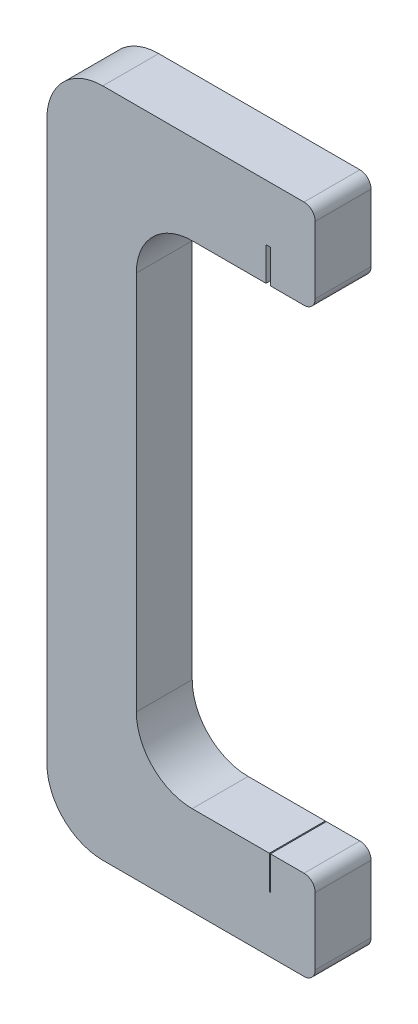
ISO-10303-21;
HEADER;
FILE_DESCRIPTION(('STEP AP214'),'2;1');
FILE_NAME('part.step','',(''),(''),'','','');
FILE_SCHEMA(('AUTOMOTIVE_DESIGN { 1 0 10303 214 1 1 1 1 }'));
ENDSEC;
DATA;
#1=APPLICATION_CONTEXT('core data for automotive mechanical design processes');
#2=APPLICATION_PROTOCOL_DEFINITION('international standard','automotive_design',2000,#1);
#3=PRODUCT_CONTEXT('',#1,'mechanical');
#4=PRODUCT('Part','Part','',(#3));
#5=PRODUCT_RELATED_PRODUCT_CATEGORY('part','',(#4));
#6=PRODUCT_DEFINITION_FORMATION('','',#4);
#7=PRODUCT_DEFINITION_CONTEXT('part definition',#1,'design');
#8=PRODUCT_DEFINITION('design','',#6,#7);
#9=PRODUCT_DEFINITION_SHAPE('','',#8);
#10=(LENGTH_UNIT() NAMED_UNIT(*) SI_UNIT(.MILLI.,.METRE.));
#11=(NAMED_UNIT(*) PLANE_ANGLE_UNIT() SI_UNIT($,.RADIAN.));
#12=(NAMED_UNIT(*) SI_UNIT($,.STERADIAN.) SOLID_ANGLE_UNIT());
#13=UNCERTAINTY_MEASURE_WITH_UNIT(LENGTH_MEASURE(1.E-05),#10,'distance_accuracy_value','');
#14=(GEOMETRIC_REPRESENTATION_CONTEXT(3) GLOBAL_UNCERTAINTY_ASSIGNED_CONTEXT((#13)) GLOBAL_UNIT_ASSIGNED_CONTEXT((#10,
#11,#12)) REPRESENTATION_CONTEXT('',''));
#15=CARTESIAN_POINT('',(0.,0.,0.));
#16=DIRECTION('',(0.,0.,1.));
#17=DIRECTION('',(1.,0.,0.));
#18=AXIS2_PLACEMENT_3D('',#15,#16,#17);
#19=CARTESIAN_POINT('',(13.,52.,5.));
#20=DIRECTION('',(0.,1.,0.));
#21=DIRECTION('',(-1.,0.,0.));
#22=AXIS2_PLACEMENT_3D('',#19,#20,#21);
#23=PLANE('',#22);
#24=DIRECTION('',(1.,0.,0.));
#25=VECTOR('',#24,1.);
#26=CARTESIAN_POINT('',(13.,52.,5.));
#27=LINE('',#26,#25);
#28=CARTESIAN_POINT('',(20.,52.,5.));
#29=VERTEX_POINT('',#28);
#30=CARTESIAN_POINT('',(23.,52.,5.));
#31=VERTEX_POINT('',#30);
#32=EDGE_CURVE('E281',#29,#31,#27,.T.);
#33=ORIENTED_EDGE('',*,*,#32,.F.);
#34=DIRECTION('',(0.,0.,1.));
#35=VECTOR('',#34,1.);
#36=CARTESIAN_POINT('',(20.,52.,0.));
#37=LINE('',#36,#35);
#38=CARTESIAN_POINT('',(20.,52.,0.));
#39=VERTEX_POINT('',#38);
#40=EDGE_CURVE('E204',#39,#29,#37,.T.);
#41=ORIENTED_EDGE('',*,*,#40,.F.);
#42=DIRECTION('',(1.,0.,0.));
#43=VECTOR('',#42,1.);
#44=CARTESIAN_POINT('',(13.,52.,0.));
#45=LINE('',#44,#43);
#46=CARTESIAN_POINT('',(23.,52.,0.));
#47=VERTEX_POINT('',#46);
#48=EDGE_CURVE('E317',#39,#47,#45,.T.);
#49=ORIENTED_EDGE('',*,*,#48,.T.);
#50=DIRECTION('',(0.,0.,-1.));
#51=VECTOR('',#50,1.);
#52=CARTESIAN_POINT('',(23.,52.,5.));
#53=LINE('',#52,#51);
#54=EDGE_CURVE('E339',#31,#47,#53,.T.);
#55=ORIENTED_EDGE('',*,*,#54,.F.);
#56=EDGE_LOOP('',(#33,#41,#49,#55));
#57=FACE_BOUND('',#56,.T.);
#58=ADVANCED_FACE('F37',(#57),#23,.F.);
#59=CARTESIAN_POINT('',(23.,8.,5.));
#60=DIRECTION('',(0.,-1.,0.));
#61=DIRECTION('',(1.,0.,0.));
#62=AXIS2_PLACEMENT_3D('',#59,#60,#61);
#63=PLANE('',#62);
#64=DIRECTION('',(-1.,0.,0.));
#65=VECTOR('',#64,1.);
#66=CARTESIAN_POINT('',(23.,8.,0.));
#67=LINE('',#66,#65);
#68=CARTESIAN_POINT('',(23.,8.,0.));
#69=VERTEX_POINT('',#68);
#70=CARTESIAN_POINT('',(20.,8.,0.));
#71=VERTEX_POINT('',#70);
#72=EDGE_CURVE('E308',#69,#71,#67,.T.);
#73=ORIENTED_EDGE('',*,*,#72,.T.);
#74=DIRECTION('',(0.,0.,-1.));
#75=VECTOR('',#74,1.);
#76=CARTESIAN_POINT('',(20.,8.,5.));
#77=LINE('',#76,#75);
#78=CARTESIAN_POINT('',(20.,8.,5.));
#79=VERTEX_POINT('',#78);
#80=EDGE_CURVE('E228',#79,#71,#77,.T.);
#81=ORIENTED_EDGE('',*,*,#80,.F.);
#82=DIRECTION('',(-1.,0.,0.));
#83=VECTOR('',#82,1.);
#84=CARTESIAN_POINT('',(23.,8.,5.));
#85=LINE('',#84,#83);
#86=CARTESIAN_POINT('',(23.,8.,5.));
#87=VERTEX_POINT('',#86);
#88=EDGE_CURVE('E272',#87,#79,#85,.T.);
#89=ORIENTED_EDGE('',*,*,#88,.F.);
#90=DIRECTION('',(0.,0.,-1.));
#91=VECTOR('',#90,1.);
#92=CARTESIAN_POINT('',(23.,8.,5.));
#93=LINE('',#92,#91);
#94=EDGE_CURVE('E354',#87,#69,#93,.T.);
#95=ORIENTED_EDGE('',*,*,#94,.T.);
#96=EDGE_LOOP('',(#73,#81,#89,#95));
#97=FACE_BOUND('',#96,.T.);
#98=ADVANCED_FACE('F420',(#97),#63,.F.);
#99=CARTESIAN_POINT('',(5.,55.,5.));
#100=DIRECTION('',(0.,0.,-1.));
#101=DIRECTION('',(-1.,0.,0.));
#102=AXIS2_PLACEMENT_3D('',#99,#100,#101);
#103=CYLINDRICAL_SURFACE('',#102,5.);
#104=CARTESIAN_POINT('',(5.,55.,0.));
#105=DIRECTION('',(0.,0.,1.));
#106=DIRECTION('',(1.,0.,0.));
#107=AXIS2_PLACEMENT_3D('',#104,#105,#106);
#108=CIRCLE('',#107,5.);
#109=CARTESIAN_POINT('',(5.,60.,0.));
#110=VERTEX_POINT('',#109);
#111=CARTESIAN_POINT('',(0.,55.,0.));
#112=VERTEX_POINT('',#111);
#113=EDGE_CURVE('E247',#110,#112,#108,.T.);
#114=ORIENTED_EDGE('',*,*,#113,.T.);
#115=DIRECTION('',(0.,0.,-1.));
#116=VECTOR('',#115,1.);
#117=CARTESIAN_POINT('',(0.,55.,5.));
#118=LINE('',#117,#116);
#119=CARTESIAN_POINT('',(0.,55.,5.));
#120=VERTEX_POINT('',#119);
#121=EDGE_CURVE('E12',#120,#112,#118,.T.);
#122=ORIENTED_EDGE('',*,*,#121,.F.);
#123=CARTESIAN_POINT('',(5.,55.,5.));
#124=DIRECTION('',(0.,0.,1.));
#125=DIRECTION('',(1.,0.,0.));
#126=AXIS2_PLACEMENT_3D('',#123,#124,#125);
#127=CIRCLE('',#126,5.);
#128=CARTESIAN_POINT('',(5.,60.,5.));
#129=VERTEX_POINT('',#128);
#130=EDGE_CURVE('E255',#129,#120,#127,.T.);
#131=ORIENTED_EDGE('',*,*,#130,.F.);
#132=DIRECTION('',(0.,0.,-1.));
#133=VECTOR('',#132,1.);
#134=CARTESIAN_POINT('',(5.,60.,5.));
#135=LINE('',#134,#133);
#136=EDGE_CURVE('E292',#129,#110,#135,.T.);
#137=ORIENTED_EDGE('',*,*,#136,.T.);
#138=EDGE_LOOP('',(#114,#122,#131,#137));
#139=FACE_BOUND('',#138,.T.);
#140=ADVANCED_FACE('F39',(#139),#103,.T.);
#141=CARTESIAN_POINT('',(0.,55.,5.));
#142=DIRECTION('',(1.,0.,0.));
#143=DIRECTION('',(0.,1.,0.));
#144=AXIS2_PLACEMENT_3D('',#141,#142,#143);
#145=PLANE('',#144);
#146=DIRECTION('',(0.,-1.,0.));
#147=VECTOR('',#146,1.);
#148=CARTESIAN_POINT('',(0.,55.,0.));
#149=LINE('',#148,#147);
#150=CARTESIAN_POINT('',(0.,5.,0.));
#151=VERTEX_POINT('',#150);
#152=EDGE_CURVE('E295',#112,#151,#149,.T.);
#153=ORIENTED_EDGE('',*,*,#152,.T.);
#154=DIRECTION('',(0.,0.,-1.));
#155=VECTOR('',#154,1.);
#156=CARTESIAN_POINT('',(0.,5.,5.));
#157=LINE('',#156,#155);
#158=CARTESIAN_POINT('',(0.,5.,5.));
#159=VERTEX_POINT('',#158);
#160=EDGE_CURVE('E45',#159,#151,#157,.T.);
#161=ORIENTED_EDGE('',*,*,#160,.F.);
#162=DIRECTION('',(0.,-1.,0.));
#163=VECTOR('',#162,1.);
#164=CARTESIAN_POINT('',(0.,55.,5.));
#165=LINE('',#164,#163);
#166=EDGE_CURVE('E258',#120,#159,#165,.T.);
#167=ORIENTED_EDGE('',*,*,#166,.F.);
#168=ORIENTED_EDGE('',*,*,#121,.T.);
#169=EDGE_LOOP('',(#153,#161,#167,#168));
#170=FACE_BOUND('',#169,.T.);
#171=ADVANCED_FACE('F395',(#170),#145,.F.);
#172=CARTESIAN_POINT('',(5.00000000000001,5.,5.));
#173=DIRECTION('',(0.,0.,-1.));
#174=DIRECTION('',(-1.,0.,0.));
#175=AXIS2_PLACEMENT_3D('',#172,#173,#174);
#176=CYLINDRICAL_SURFACE('',#175,5.);
#177=CARTESIAN_POINT('',(5.00000000000001,5.,0.));
#178=DIRECTION('',(0.,0.,1.));
#179=DIRECTION('',(-1.,0.,0.));
#180=AXIS2_PLACEMENT_3D('',#177,#178,#179);
#181=CIRCLE('',#180,5.);
#182=CARTESIAN_POINT('',(5.00000000000001,0.,0.));
#183=VERTEX_POINT('',#182);
#184=EDGE_CURVE('E297',#151,#183,#181,.T.);
#185=ORIENTED_EDGE('',*,*,#184,.T.);
#186=DIRECTION('',(0.,0.,-1.));
#187=VECTOR('',#186,1.);
#188=CARTESIAN_POINT('',(5.00000000000001,0.,5.));
#189=LINE('',#188,#187);
#190=CARTESIAN_POINT('',(5.00000000000001,0.,5.));
#191=VERTEX_POINT('',#190);
#192=EDGE_CURVE('E366',#191,#183,#189,.T.);
#193=ORIENTED_EDGE('',*,*,#192,.F.);
#194=CARTESIAN_POINT('',(5.00000000000001,5.,5.));
#195=DIRECTION('',(0.,0.,1.));
#196=DIRECTION('',(-1.,0.,0.));
#197=AXIS2_PLACEMENT_3D('',#194,#195,#196);
#198=CIRCLE('',#197,5.);
#199=EDGE_CURVE('E261',#159,#191,#198,.T.);
#200=ORIENTED_EDGE('',*,*,#199,.F.);
#201=ORIENTED_EDGE('',*,*,#160,.T.);
#202=EDGE_LOOP('',(#185,#193,#200,#201));
#203=FACE_BOUND('',#202,.T.);
#204=ADVANCED_FACE('F373',(#203),#176,.T.);
#205=CARTESIAN_POINT('',(5.00000000000001,0.,5.));
#206=DIRECTION('',(0.,1.,0.));
#207=DIRECTION('',(0.,0.,1.));
#208=AXIS2_PLACEMENT_3D('',#205,#206,#207);
#209=PLANE('',#208);
#210=DIRECTION('',(1.,0.,0.));
#211=VECTOR('',#210,1.);
#212=CARTESIAN_POINT('',(5.00000000000001,0.,0.));
#213=LINE('',#212,#211);
#214=CARTESIAN_POINT('',(23.,0.,0.));
#215=VERTEX_POINT('',#214);
#216=EDGE_CURVE('E299',#183,#215,#213,.T.);
#217=ORIENTED_EDGE('',*,*,#216,.T.);
#218=DIRECTION('',(0.,0.,-1.));
#219=VECTOR('',#218,1.);
#220=CARTESIAN_POINT('',(23.,0.,5.));
#221=LINE('',#220,#219);
#222=CARTESIAN_POINT('',(23.,0.,5.));
#223=VERTEX_POINT('',#222);
#224=EDGE_CURVE('E363',#223,#215,#221,.T.);
#225=ORIENTED_EDGE('',*,*,#224,.F.);
#226=DIRECTION('',(1.,0.,0.));
#227=VECTOR('',#226,1.);
#228=CARTESIAN_POINT('',(5.00000000000001,0.,5.));
#229=LINE('',#228,#227);
#230=EDGE_CURVE('E263',#191,#223,#229,.T.);
#231=ORIENTED_EDGE('',*,*,#230,.F.);
#232=ORIENTED_EDGE('',*,*,#192,.T.);
#233=EDGE_LOOP('',(#217,#225,#231,#232));
#234=FACE_BOUND('',#233,.T.);
#235=ADVANCED_FACE('F385',(#234),#209,.F.);
#236=CARTESIAN_POINT('',(23.,1.,5.));
#237=DIRECTION('',(0.,0.,-1.));
#238=DIRECTION('',(-1.,0.,0.));
#239=AXIS2_PLACEMENT_3D('',#236,#237,#238);
#240=CYLINDRICAL_SURFACE('',#239,1.);
#241=CARTESIAN_POINT('',(23.,1.,0.));
#242=DIRECTION('',(0.,0.,1.));
#243=DIRECTION('',(-1.,0.,0.));
#244=AXIS2_PLACEMENT_3D('',#241,#242,#243);
#245=CIRCLE('',#244,1.);
#246=CARTESIAN_POINT('',(24.,1.,0.));
#247=VERTEX_POINT('',#246);
#248=EDGE_CURVE('E301',#215,#247,#245,.T.);
#249=ORIENTED_EDGE('',*,*,#248,.T.);
#250=DIRECTION('',(0.,0.,-1.));
#251=VECTOR('',#250,1.);
#252=CARTESIAN_POINT('',(24.,1.,5.));
#253=LINE('',#252,#251);
#254=CARTESIAN_POINT('',(24.,1.,5.));
#255=VERTEX_POINT('',#254);
#256=EDGE_CURVE('E360',#255,#247,#253,.T.);
#257=ORIENTED_EDGE('',*,*,#256,.F.);
#258=CARTESIAN_POINT('',(23.,1.,5.));
#259=DIRECTION('',(0.,0.,1.));
#260=DIRECTION('',(-1.,0.,0.));
#261=AXIS2_PLACEMENT_3D('',#258,#259,#260);
#262=CIRCLE('',#261,1.);
#263=EDGE_CURVE('E265',#223,#255,#262,.T.);
#264=ORIENTED_EDGE('',*,*,#263,.F.);
#265=ORIENTED_EDGE('',*,*,#224,.T.);
#266=EDGE_LOOP('',(#249,#257,#264,#265));
#267=FACE_BOUND('',#266,.T.);
#268=ADVANCED_FACE('F389',(#267),#240,.T.);
#269=CARTESIAN_POINT('',(24.,1.,5.));
#270=DIRECTION('',(-1.,0.,0.));
#271=DIRECTION('',(0.,0.,1.));
#272=AXIS2_PLACEMENT_3D('',#269,#270,#271);
#273=PLANE('',#272);
#274=DIRECTION('',(0.,1.,0.));
#275=VECTOR('',#274,1.);
#276=CARTESIAN_POINT('',(24.,1.,0.));
#277=LINE('',#276,#275);
#278=CARTESIAN_POINT('',(24.,7.,0.));
#279=VERTEX_POINT('',#278);
#280=EDGE_CURVE('E303',#247,#279,#277,.T.);
#281=ORIENTED_EDGE('',*,*,#280,.T.);
#282=DIRECTION('',(0.,0.,-1.));
#283=VECTOR('',#282,1.);
#284=CARTESIAN_POINT('',(24.,7.,5.));
#285=LINE('',#284,#283);
#286=CARTESIAN_POINT('',(24.,7.,5.));
#287=VERTEX_POINT('',#286);
#288=EDGE_CURVE('E357',#287,#279,#285,.T.);
#289=ORIENTED_EDGE('',*,*,#288,.F.);
#290=DIRECTION('',(0.,1.,0.));
#291=VECTOR('',#290,1.);
#292=CARTESIAN_POINT('',(24.,1.,5.));
#293=LINE('',#292,#291);
#294=EDGE_CURVE('E267',#255,#287,#293,.T.);
#295=ORIENTED_EDGE('',*,*,#294,.F.);
#296=ORIENTED_EDGE('',*,*,#256,.T.);
#297=EDGE_LOOP('',(#281,#289,#295,#296));
#298=FACE_BOUND('',#297,.T.);
#299=ADVANCED_FACE('F596',(#298),#273,.F.);
#300=CARTESIAN_POINT('',(23.,7.,5.));
#301=DIRECTION('',(0.,0.,-1.));
#302=DIRECTION('',(-1.,0.,0.));
#303=AXIS2_PLACEMENT_3D('',#300,#301,#302);
#304=CYLINDRICAL_SURFACE('',#303,1.);
#305=CARTESIAN_POINT('',(23.,7.,0.));
#306=DIRECTION('',(0.,0.,1.));
#307=DIRECTION('',(1.,0.,0.));
#308=AXIS2_PLACEMENT_3D('',#305,#306,#307);
#309=CIRCLE('',#308,1.);
#310=EDGE_CURVE('E305',#279,#69,#309,.T.);
#311=ORIENTED_EDGE('',*,*,#310,.T.);
#312=ORIENTED_EDGE('',*,*,#94,.F.);
#313=CARTESIAN_POINT('',(23.,7.,5.));
#314=DIRECTION('',(0.,0.,1.));
#315=DIRECTION('',(1.,0.,0.));
#316=AXIS2_PLACEMENT_3D('',#313,#314,#315);
#317=CIRCLE('',#316,1.);
#318=EDGE_CURVE('E269',#287,#87,#317,.T.);
#319=ORIENTED_EDGE('',*,*,#318,.F.);
#320=ORIENTED_EDGE('',*,*,#288,.T.);
#321=EDGE_LOOP('',(#311,#312,#319,#320));
#322=FACE_BOUND('',#321,.T.);
#323=ADVANCED_FACE('F589',(#322),#304,.T.);
#324=CARTESIAN_POINT('',(19.9,8.,5.));
#325=VERTEX_POINT('',#324);
#326=CARTESIAN_POINT('',(13.,8.,5.));
#327=VERTEX_POINT('',#326);
#328=EDGE_CURVE('E271',#325,#327,#85,.T.);
#329=ORIENTED_EDGE('',*,*,#328,.F.);
#330=DIRECTION('',(0.,0.,1.));
#331=VECTOR('',#330,1.);
#332=CARTESIAN_POINT('',(19.9,8.,5.));
#333=LINE('',#332,#331);
#334=CARTESIAN_POINT('',(19.9,8.,0.));
#335=VERTEX_POINT('',#334);
#336=EDGE_CURVE('E235',#335,#325,#333,.T.);
#337=ORIENTED_EDGE('',*,*,#336,.F.);
#338=CARTESIAN_POINT('',(13.,8.,0.));
#339=VERTEX_POINT('',#338);
#340=EDGE_CURVE('E307',#335,#339,#67,.T.);
#341=ORIENTED_EDGE('',*,*,#340,.T.);
#342=DIRECTION('',(0.,0.,-1.));
#343=VECTOR('',#342,1.);
#344=CARTESIAN_POINT('',(13.,8.,5.));
#345=LINE('',#344,#343);
#346=EDGE_CURVE('E351',#327,#339,#345,.T.);
#347=ORIENTED_EDGE('',*,*,#346,.F.);
#348=EDGE_LOOP('',(#329,#337,#341,#347));
#349=FACE_BOUND('',#348,.T.);
#350=ADVANCED_FACE('F428',(#349),#63,.F.);
#351=CARTESIAN_POINT('',(13.,13.,5.));
#352=DIRECTION('',(0.,0.,-1.));
#353=DIRECTION('',(-1.,0.,0.));
#354=AXIS2_PLACEMENT_3D('',#351,#352,#353);
#355=CYLINDRICAL_SURFACE('',#354,5.);
#356=CARTESIAN_POINT('',(13.,13.,0.));
#357=DIRECTION('',(0.,0.,-1.));
#358=DIRECTION('',(-1.,0.,0.));
#359=AXIS2_PLACEMENT_3D('',#356,#357,#358);
#360=CIRCLE('',#359,5.);
#361=CARTESIAN_POINT('',(8.00000000000001,13.,0.));
#362=VERTEX_POINT('',#361);
#363=EDGE_CURVE('E311',#339,#362,#360,.T.);
#364=ORIENTED_EDGE('',*,*,#363,.T.);
#365=DIRECTION('',(0.,0.,-1.));
#366=VECTOR('',#365,1.);
#367=CARTESIAN_POINT('',(8.00000000000001,13.,5.));
#368=LINE('',#367,#366);
#369=CARTESIAN_POINT('',(8.00000000000001,13.,5.));
#370=VERTEX_POINT('',#369);
#371=EDGE_CURVE('E348',#370,#362,#368,.T.);
#372=ORIENTED_EDGE('',*,*,#371,.F.);
#373=CARTESIAN_POINT('',(13.,13.,5.));
#374=DIRECTION('',(0.,0.,-1.));
#375=DIRECTION('',(-1.,0.,0.));
#376=AXIS2_PLACEMENT_3D('',#373,#374,#375);
#377=CIRCLE('',#376,5.);
#378=EDGE_CURVE('E275',#327,#370,#377,.T.);
#379=ORIENTED_EDGE('',*,*,#378,.F.);
#380=ORIENTED_EDGE('',*,*,#346,.T.);
#381=EDGE_LOOP('',(#364,#372,#379,#380));
#382=FACE_BOUND('',#381,.T.);
#383=ADVANCED_FACE('F572',(#382),#355,.F.);
#384=CARTESIAN_POINT('',(8.00000000000001,13.,5.));
#385=DIRECTION('',(-1.,0.,0.));
#386=DIRECTION('',(0.,-1.,0.));
#387=AXIS2_PLACEMENT_3D('',#384,#385,#386);
#388=PLANE('',#387);
#389=DIRECTION('',(0.,1.,0.));
#390=VECTOR('',#389,1.);
#391=CARTESIAN_POINT('',(8.00000000000001,13.,0.));
#392=LINE('',#391,#390);
#393=CARTESIAN_POINT('',(8.,47.,0.));
#394=VERTEX_POINT('',#393);
#395=EDGE_CURVE('E313',#362,#394,#392,.T.);
#396=ORIENTED_EDGE('',*,*,#395,.T.);
#397=DIRECTION('',(0.,0.,-1.));
#398=VECTOR('',#397,1.);
#399=CARTESIAN_POINT('',(8.,47.,5.));
#400=LINE('',#399,#398);
#401=CARTESIAN_POINT('',(8.,47.,5.));
#402=VERTEX_POINT('',#401);
#403=EDGE_CURVE('E345',#402,#394,#400,.T.);
#404=ORIENTED_EDGE('',*,*,#403,.F.);
#405=DIRECTION('',(0.,1.,0.));
#406=VECTOR('',#405,1.);
#407=CARTESIAN_POINT('',(8.00000000000001,13.,5.));
#408=LINE('',#407,#406);
#409=EDGE_CURVE('E277',#370,#402,#408,.T.);
#410=ORIENTED_EDGE('',*,*,#409,.F.);
#411=ORIENTED_EDGE('',*,*,#371,.T.);
#412=EDGE_LOOP('',(#396,#404,#410,#411));
#413=FACE_BOUND('',#412,.T.);
#414=ADVANCED_FACE('F438',(#413),#388,.F.);
#415=CARTESIAN_POINT('',(13.,47.,5.));
#416=DIRECTION('',(0.,0.,-1.));
#417=DIRECTION('',(-1.,0.,0.));
#418=AXIS2_PLACEMENT_3D('',#415,#416,#417);
#419=CYLINDRICAL_SURFACE('',#418,5.);
#420=CARTESIAN_POINT('',(13.,47.,0.));
#421=DIRECTION('',(0.,0.,-1.));
#422=DIRECTION('',(1.,0.,0.));
#423=AXIS2_PLACEMENT_3D('',#420,#421,#422);
#424=CIRCLE('',#423,5.);
#425=CARTESIAN_POINT('',(13.,52.,0.));
#426=VERTEX_POINT('',#425);
#427=EDGE_CURVE('E315',#394,#426,#424,.T.);
#428=ORIENTED_EDGE('',*,*,#427,.T.);
#429=DIRECTION('',(0.,0.,-1.));
#430=VECTOR('',#429,1.);
#431=CARTESIAN_POINT('',(13.,52.,5.));
#432=LINE('',#431,#430);
#433=CARTESIAN_POINT('',(13.,52.,5.));
#434=VERTEX_POINT('',#433);
#435=EDGE_CURVE('E342',#434,#426,#432,.T.);
#436=ORIENTED_EDGE('',*,*,#435,.F.);
#437=CARTESIAN_POINT('',(13.,47.,5.));
#438=DIRECTION('',(0.,0.,-1.));
#439=DIRECTION('',(1.,0.,0.));
#440=AXIS2_PLACEMENT_3D('',#437,#438,#439);
#441=CIRCLE('',#440,5.);
#442=EDGE_CURVE('E279',#402,#434,#441,.T.);
#443=ORIENTED_EDGE('',*,*,#442,.F.);
#444=ORIENTED_EDGE('',*,*,#403,.T.);
#445=EDGE_LOOP('',(#428,#436,#443,#444));
#446=FACE_BOUND('',#445,.T.);
#447=ADVANCED_FACE('F432',(#446),#419,.F.);
#448=CARTESIAN_POINT('',(19.6,52.,0.));
#449=VERTEX_POINT('',#448);
#450=EDGE_CURVE('E318',#426,#449,#45,.T.);
#451=ORIENTED_EDGE('',*,*,#450,.T.);
#452=DIRECTION('',(0.,0.,-1.));
#453=VECTOR('',#452,1.);
#454=CARTESIAN_POINT('',(19.6,52.,0.));
#455=LINE('',#454,#453);
#456=CARTESIAN_POINT('',(19.6,52.,5.));
#457=VERTEX_POINT('',#456);
#458=EDGE_CURVE('E216',#457,#449,#455,.T.);
#459=ORIENTED_EDGE('',*,*,#458,.F.);
#460=EDGE_CURVE('E282',#434,#457,#27,.T.);
#461=ORIENTED_EDGE('',*,*,#460,.F.);
#462=ORIENTED_EDGE('',*,*,#435,.T.);
#463=EDGE_LOOP('',(#451,#459,#461,#462));
#464=FACE_BOUND('',#463,.T.);
#465=ADVANCED_FACE('F422',(#464),#23,.F.);
#466=CARTESIAN_POINT('',(23.,53.,5.));
#467=DIRECTION('',(0.,0.,-1.));
#468=DIRECTION('',(-1.,0.,0.));
#469=AXIS2_PLACEMENT_3D('',#466,#467,#468);
#470=CYLINDRICAL_SURFACE('',#469,1.);
#471=CARTESIAN_POINT('',(23.,53.,0.));
#472=DIRECTION('',(0.,0.,1.));
#473=DIRECTION('',(-1.,0.,0.));
#474=AXIS2_PLACEMENT_3D('',#471,#472,#473);
#475=CIRCLE('',#474,1.);
#476=CARTESIAN_POINT('',(24.,53.,0.));
#477=VERTEX_POINT('',#476);
#478=EDGE_CURVE('E321',#47,#477,#475,.T.);
#479=ORIENTED_EDGE('',*,*,#478,.T.);
#480=DIRECTION('',(0.,0.,-1.));
#481=VECTOR('',#480,1.);
#482=CARTESIAN_POINT('',(24.,53.,5.));
#483=LINE('',#482,#481);
#484=CARTESIAN_POINT('',(24.,53.,5.));
#485=VERTEX_POINT('',#484);
#486=EDGE_CURVE('E336',#485,#477,#483,.T.);
#487=ORIENTED_EDGE('',*,*,#486,.F.);
#488=CARTESIAN_POINT('',(23.,53.,5.));
#489=DIRECTION('',(0.,0.,1.));
#490=DIRECTION('',(-1.,0.,0.));
#491=AXIS2_PLACEMENT_3D('',#488,#489,#490);
#492=CIRCLE('',#491,1.);
#493=EDGE_CURVE('E284',#31,#485,#492,.T.);
#494=ORIENTED_EDGE('',*,*,#493,.F.);
#495=ORIENTED_EDGE('',*,*,#54,.T.);
#496=EDGE_LOOP('',(#479,#487,#494,#495));
#497=FACE_BOUND('',#496,.T.);
#498=ADVANCED_FACE('F415',(#497),#470,.T.);
#499=CARTESIAN_POINT('',(24.,53.,5.));
#500=DIRECTION('',(-1.,0.,0.));
#501=DIRECTION('',(0.,0.,1.));
#502=AXIS2_PLACEMENT_3D('',#499,#500,#501);
#503=PLANE('',#502);
#504=DIRECTION('',(0.,1.,0.));
#505=VECTOR('',#504,1.);
#506=CARTESIAN_POINT('',(24.,53.,0.));
#507=LINE('',#506,#505);
#508=CARTESIAN_POINT('',(24.,59.,0.));
#509=VERTEX_POINT('',#508);
#510=EDGE_CURVE('E323',#477,#509,#507,.T.);
#511=ORIENTED_EDGE('',*,*,#510,.T.);
#512=DIRECTION('',(0.,0.,-1.));
#513=VECTOR('',#512,1.);
#514=CARTESIAN_POINT('',(24.,59.,5.));
#515=LINE('',#514,#513);
#516=CARTESIAN_POINT('',(24.,59.,5.));
#517=VERTEX_POINT('',#516);
#518=EDGE_CURVE('E333',#517,#509,#515,.T.);
#519=ORIENTED_EDGE('',*,*,#518,.F.);
#520=DIRECTION('',(0.,1.,0.));
#521=VECTOR('',#520,1.);
#522=CARTESIAN_POINT('',(24.,53.,5.));
#523=LINE('',#522,#521);
#524=EDGE_CURVE('E286',#485,#517,#523,.T.);
#525=ORIENTED_EDGE('',*,*,#524,.F.);
#526=ORIENTED_EDGE('',*,*,#486,.T.);
#527=EDGE_LOOP('',(#511,#519,#525,#526));
#528=FACE_BOUND('',#527,.T.);
#529=ADVANCED_FACE('F411',(#528),#503,.F.);
#530=CARTESIAN_POINT('',(23.,59.,5.));
#531=DIRECTION('',(0.,0.,-1.));
#532=DIRECTION('',(-1.,0.,0.));
#533=AXIS2_PLACEMENT_3D('',#530,#531,#532);
#534=CYLINDRICAL_SURFACE('',#533,1.);
#535=CARTESIAN_POINT('',(23.,59.,0.));
#536=DIRECTION('',(0.,0.,1.));
#537=DIRECTION('',(1.,0.,0.));
#538=AXIS2_PLACEMENT_3D('',#535,#536,#537);
#539=CIRCLE('',#538,1.);
#540=CARTESIAN_POINT('',(23.,60.,0.));
#541=VERTEX_POINT('',#540);
#542=EDGE_CURVE('E325',#509,#541,#539,.T.);
#543=ORIENTED_EDGE('',*,*,#542,.T.);
#544=DIRECTION('',(0.,0.,-1.));
#545=VECTOR('',#544,1.);
#546=CARTESIAN_POINT('',(23.,60.,5.));
#547=LINE('',#546,#545);
#548=CARTESIAN_POINT('',(23.,60.,5.));
#549=VERTEX_POINT('',#548);
#550=EDGE_CURVE('E330',#549,#541,#547,.T.);
#551=ORIENTED_EDGE('',*,*,#550,.F.);
#552=CARTESIAN_POINT('',(23.,59.,5.));
#553=DIRECTION('',(0.,0.,1.));
#554=DIRECTION('',(1.,0.,0.));
#555=AXIS2_PLACEMENT_3D('',#552,#553,#554);
#556=CIRCLE('',#555,1.);
#557=EDGE_CURVE('E288',#517,#549,#556,.T.);
#558=ORIENTED_EDGE('',*,*,#557,.F.);
#559=ORIENTED_EDGE('',*,*,#518,.T.);
#560=EDGE_LOOP('',(#543,#551,#558,#559));
#561=FACE_BOUND('',#560,.T.);
#562=ADVANCED_FACE('F407',(#561),#534,.T.);
#563=CARTESIAN_POINT('',(23.,60.,5.));
#564=DIRECTION('',(0.,-1.,0.));
#565=DIRECTION('',(0.,0.,-1.));
#566=AXIS2_PLACEMENT_3D('',#563,#564,#565);
#567=PLANE('',#566);
#568=DIRECTION('',(-1.,0.,0.));
#569=VECTOR('',#568,1.);
#570=CARTESIAN_POINT('',(23.,60.,0.));
#571=LINE('',#570,#569);
#572=EDGE_CURVE('E259',#541,#110,#571,.T.);
#573=ORIENTED_EDGE('',*,*,#572,.T.);
#574=ORIENTED_EDGE('',*,*,#136,.F.);
#575=DIRECTION('',(-1.,0.,0.));
#576=VECTOR('',#575,1.);
#577=CARTESIAN_POINT('',(23.,60.,5.));
#578=LINE('',#577,#576);
#579=EDGE_CURVE('E290',#549,#129,#578,.T.);
#580=ORIENTED_EDGE('',*,*,#579,.F.);
#581=ORIENTED_EDGE('',*,*,#550,.T.);
#582=EDGE_LOOP('',(#573,#574,#580,#581));
#583=FACE_BOUND('',#582,.T.);
#584=ADVANCED_FACE('F402',(#583),#567,.F.);
#585=CARTESIAN_POINT('',(5.,55.,5.));
#586=DIRECTION('',(0.,0.,1.));
#587=DIRECTION('',(1.,0.,0.));
#588=AXIS2_PLACEMENT_3D('',#585,#586,#587);
#589=PLANE('',#588);
#590=DIRECTION('',(0.,-1.,0.));
#591=VECTOR('',#590,1.);
#592=CARTESIAN_POINT('',(20.,55.,5.));
#593=LINE('',#592,#591);
#594=CARTESIAN_POINT('',(20.,55.,5.));
#595=VERTEX_POINT('',#594);
#596=EDGE_CURVE('E199',#595,#29,#593,.T.);
#597=ORIENTED_EDGE('',*,*,#596,.T.);
#598=ORIENTED_EDGE('',*,*,#32,.T.);
#599=ORIENTED_EDGE('',*,*,#493,.T.);
#600=ORIENTED_EDGE('',*,*,#524,.T.);
#601=ORIENTED_EDGE('',*,*,#557,.T.);
#602=ORIENTED_EDGE('',*,*,#579,.T.);
#603=ORIENTED_EDGE('',*,*,#130,.T.);
#604=ORIENTED_EDGE('',*,*,#166,.T.);
#605=ORIENTED_EDGE('',*,*,#199,.T.);
#606=ORIENTED_EDGE('',*,*,#230,.T.);
#607=ORIENTED_EDGE('',*,*,#263,.T.);
#608=ORIENTED_EDGE('',*,*,#294,.T.);
#609=ORIENTED_EDGE('',*,*,#318,.T.);
#610=ORIENTED_EDGE('',*,*,#88,.T.);
#611=DIRECTION('',(0.,1.,0.));
#612=VECTOR('',#611,1.);
#613=CARTESIAN_POINT('',(20.,5.,5.));
#614=LINE('',#613,#612);
#615=CARTESIAN_POINT('',(20.,5.,5.));
#616=VERTEX_POINT('',#615);
#617=EDGE_CURVE('E245',#616,#79,#614,.T.);
#618=ORIENTED_EDGE('',*,*,#617,.F.);
#619=DIRECTION('',(1.,0.,0.));
#620=VECTOR('',#619,1.);
#621=CARTESIAN_POINT('',(19.9,5.,5.));
#622=LINE('',#621,#620);
#623=CARTESIAN_POINT('',(19.9,5.,5.));
#624=VERTEX_POINT('',#623);
#625=EDGE_CURVE('E240',#624,#616,#622,.T.);
#626=ORIENTED_EDGE('',*,*,#625,.F.);
#627=DIRECTION('',(0.,1.,0.));
#628=VECTOR('',#627,1.);
#629=CARTESIAN_POINT('',(19.9,5.,5.));
#630=LINE('',#629,#628);
#631=EDGE_CURVE('E248',#624,#325,#630,.T.);
#632=ORIENTED_EDGE('',*,*,#631,.T.);
#633=ORIENTED_EDGE('',*,*,#328,.T.);
#634=ORIENTED_EDGE('',*,*,#378,.T.);
#635=ORIENTED_EDGE('',*,*,#409,.T.);
#636=ORIENTED_EDGE('',*,*,#442,.T.);
#637=ORIENTED_EDGE('',*,*,#460,.T.);
#638=DIRECTION('',(0.,-1.,0.));
#639=VECTOR('',#638,1.);
#640=CARTESIAN_POINT('',(19.6,55.,5.));
#641=LINE('',#640,#639);
#642=CARTESIAN_POINT('',(19.6,55.,5.));
#643=VERTEX_POINT('',#642);
#644=EDGE_CURVE('E208',#643,#457,#641,.T.);
#645=ORIENTED_EDGE('',*,*,#644,.F.);
#646=DIRECTION('',(-1.,0.,0.));
#647=VECTOR('',#646,1.);
#648=CARTESIAN_POINT('',(19.6,55.,5.));
#649=LINE('',#648,#647);
#650=EDGE_CURVE('E212',#595,#643,#649,.T.);
#651=ORIENTED_EDGE('',*,*,#650,.F.);
#652=EDGE_LOOP('',(#597,#598,#599,#600,#601,#602,#603,#604,#605,#606,#607,#608,#609,#610,#618,
#626,#632,#633,#634,#635,#636,#637,#645,#651));
#653=FACE_BOUND('',#652,.T.);
#654=ADVANCED_FACE('F218',(#653),#589,.T.);
#655=CARTESIAN_POINT('',(5.,55.,0.));
#656=DIRECTION('',(0.,0.,1.));
#657=DIRECTION('',(1.,0.,0.));
#658=AXIS2_PLACEMENT_3D('',#655,#656,#657);
#659=PLANE('',#658);
#660=ORIENTED_EDGE('',*,*,#48,.F.);
#661=DIRECTION('',(0.,-1.,0.));
#662=VECTOR('',#661,1.);
#663=CARTESIAN_POINT('',(20.,55.,0.));
#664=LINE('',#663,#662);
#665=CARTESIAN_POINT('',(20.,55.,0.));
#666=VERTEX_POINT('',#665);
#667=EDGE_CURVE('E226',#666,#39,#664,.T.);
#668=ORIENTED_EDGE('',*,*,#667,.F.);
#669=DIRECTION('',(1.,0.,0.));
#670=VECTOR('',#669,1.);
#671=CARTESIAN_POINT('',(19.6,55.,0.));
#672=LINE('',#671,#670);
#673=CARTESIAN_POINT('',(19.6,55.,0.));
#674=VERTEX_POINT('',#673);
#675=EDGE_CURVE('E209',#674,#666,#672,.T.);
#676=ORIENTED_EDGE('',*,*,#675,.F.);
#677=DIRECTION('',(0.,-1.,0.));
#678=VECTOR('',#677,1.);
#679=CARTESIAN_POINT('',(19.6,55.,0.));
#680=LINE('',#679,#678);
#681=EDGE_CURVE('E229',#674,#449,#680,.T.);
#682=ORIENTED_EDGE('',*,*,#681,.T.);
#683=ORIENTED_EDGE('',*,*,#450,.F.);
#684=ORIENTED_EDGE('',*,*,#427,.F.);
#685=ORIENTED_EDGE('',*,*,#395,.F.);
#686=ORIENTED_EDGE('',*,*,#363,.F.);
#687=ORIENTED_EDGE('',*,*,#340,.F.);
#688=DIRECTION('',(0.,1.,0.));
#689=VECTOR('',#688,1.);
#690=CARTESIAN_POINT('',(19.9,5.,0.));
#691=LINE('',#690,#689);
#692=CARTESIAN_POINT('',(19.9,5.,0.));
#693=VERTEX_POINT('',#692);
#694=EDGE_CURVE('E251',#693,#335,#691,.T.);
#695=ORIENTED_EDGE('',*,*,#694,.F.);
#696=DIRECTION('',(-1.,0.,0.));
#697=VECTOR('',#696,1.);
#698=CARTESIAN_POINT('',(19.9,5.,0.));
#699=LINE('',#698,#697);
#700=CARTESIAN_POINT('',(20.,5.,0.));
#701=VERTEX_POINT('',#700);
#702=EDGE_CURVE('E234',#701,#693,#699,.T.);
#703=ORIENTED_EDGE('',*,*,#702,.F.);
#704=DIRECTION('',(0.,1.,0.));
#705=VECTOR('',#704,1.);
#706=CARTESIAN_POINT('',(20.,5.,0.));
#707=LINE('',#706,#705);
#708=EDGE_CURVE('E242',#701,#71,#707,.T.);
#709=ORIENTED_EDGE('',*,*,#708,.T.);
#710=ORIENTED_EDGE('',*,*,#72,.F.);
#711=ORIENTED_EDGE('',*,*,#310,.F.);
#712=ORIENTED_EDGE('',*,*,#280,.F.);
#713=ORIENTED_EDGE('',*,*,#248,.F.);
#714=ORIENTED_EDGE('',*,*,#216,.F.);
#715=ORIENTED_EDGE('',*,*,#184,.F.);
#716=ORIENTED_EDGE('',*,*,#152,.F.);
#717=ORIENTED_EDGE('',*,*,#113,.F.);
#718=ORIENTED_EDGE('',*,*,#572,.F.);
#719=ORIENTED_EDGE('',*,*,#542,.F.);
#720=ORIENTED_EDGE('',*,*,#510,.F.);
#721=ORIENTED_EDGE('',*,*,#478,.F.);
#722=EDGE_LOOP('',(#660,#668,#676,#682,#683,#684,#685,#686,#687,#695,#703,#709,#710,#711,#712,
#713,#714,#715,#716,#717,#718,#719,#720,#721));
#723=FACE_BOUND('',#722,.T.);
#724=ADVANCED_FACE('F379',(#723),#659,.F.);
#725=CARTESIAN_POINT('',(20.,5.,5.));
#726=DIRECTION('',(1.,0.,0.));
#727=DIRECTION('',(0.,1.,0.));
#728=AXIS2_PLACEMENT_3D('',#725,#726,#727);
#729=PLANE('',#728);
#730=ORIENTED_EDGE('',*,*,#80,.T.);
#731=ORIENTED_EDGE('',*,*,#708,.F.);
#732=DIRECTION('',(0.,0.,-1.));
#733=VECTOR('',#732,1.);
#734=CARTESIAN_POINT('',(20.,5.,5.));
#735=LINE('',#734,#733);
#736=EDGE_CURVE('E60',#616,#701,#735,.T.);
#737=ORIENTED_EDGE('',*,*,#736,.F.);
#738=ORIENTED_EDGE('',*,*,#617,.T.);
#739=EDGE_LOOP('',(#730,#731,#737,#738));
#740=FACE_BOUND('',#739,.T.);
#741=ADVANCED_FACE('F463',(#740),#729,.F.);
#742=CARTESIAN_POINT('',(19.9,5.,5.));
#743=DIRECTION('',(-1.,0.,0.));
#744=DIRECTION('',(0.,-1.,0.));
#745=AXIS2_PLACEMENT_3D('',#742,#743,#744);
#746=PLANE('',#745);
#747=ORIENTED_EDGE('',*,*,#336,.T.);
#748=ORIENTED_EDGE('',*,*,#631,.F.);
#749=DIRECTION('',(0.,0.,1.));
#750=VECTOR('',#749,1.);
#751=CARTESIAN_POINT('',(19.9,5.,5.));
#752=LINE('',#751,#750);
#753=EDGE_CURVE('E237',#693,#624,#752,.T.);
#754=ORIENTED_EDGE('',*,*,#753,.F.);
#755=ORIENTED_EDGE('',*,*,#694,.T.);
#756=EDGE_LOOP('',(#747,#748,#754,#755));
#757=FACE_BOUND('',#756,.T.);
#758=ADVANCED_FACE('F460',(#757),#746,.F.);
#759=CARTESIAN_POINT('',(0.,5.,0.));
#760=DIRECTION('',(0.,-1.,0.));
#761=DIRECTION('',(0.,0.,-1.));
#762=AXIS2_PLACEMENT_3D('',#759,#760,#761);
#763=PLANE('',#762);
#764=ORIENTED_EDGE('',*,*,#736,.T.);
#765=ORIENTED_EDGE('',*,*,#702,.T.);
#766=ORIENTED_EDGE('',*,*,#753,.T.);
#767=ORIENTED_EDGE('',*,*,#625,.T.);
#768=EDGE_LOOP('',(#764,#765,#766,#767));
#769=FACE_BOUND('',#768,.T.);
#770=ADVANCED_FACE('F455',(#769),#763,.F.);
#771=CARTESIAN_POINT('',(20.,55.,0.));
#772=DIRECTION('',(1.,0.,0.));
#773=DIRECTION('',(0.,0.,-1.));
#774=AXIS2_PLACEMENT_3D('',#771,#772,#773);
#775=PLANE('',#774);
#776=ORIENTED_EDGE('',*,*,#40,.T.);
#777=ORIENTED_EDGE('',*,*,#596,.F.);
#778=DIRECTION('',(0.,0.,1.));
#779=VECTOR('',#778,1.);
#780=CARTESIAN_POINT('',(20.,55.,0.));
#781=LINE('',#780,#779);
#782=EDGE_CURVE('E202',#666,#595,#781,.T.);
#783=ORIENTED_EDGE('',*,*,#782,.F.);
#784=ORIENTED_EDGE('',*,*,#667,.T.);
#785=EDGE_LOOP('',(#776,#777,#783,#784));
#786=FACE_BOUND('',#785,.T.);
#787=ADVANCED_FACE('F201',(#786),#775,.F.);
#788=CARTESIAN_POINT('',(19.6,55.,0.));
#789=DIRECTION('',(-1.,0.,0.));
#790=DIRECTION('',(0.,0.,1.));
#791=AXIS2_PLACEMENT_3D('',#788,#789,#790);
#792=PLANE('',#791);
#793=ORIENTED_EDGE('',*,*,#458,.T.);
#794=ORIENTED_EDGE('',*,*,#681,.F.);
#795=DIRECTION('',(0.,0.,-1.));
#796=VECTOR('',#795,1.);
#797=CARTESIAN_POINT('',(19.6,55.,0.));
#798=LINE('',#797,#796);
#799=EDGE_CURVE('E52',#643,#674,#798,.T.);
#800=ORIENTED_EDGE('',*,*,#799,.F.);
#801=ORIENTED_EDGE('',*,*,#644,.T.);
#802=EDGE_LOOP('',(#793,#794,#800,#801));
#803=FACE_BOUND('',#802,.T.);
#804=ADVANCED_FACE('F447',(#803),#792,.F.);
#805=CARTESIAN_POINT('',(0.,55.,0.));
#806=DIRECTION('',(0.,1.,0.));
#807=DIRECTION('',(0.,0.,1.));
#808=AXIS2_PLACEMENT_3D('',#805,#806,#807);
#809=PLANE('',#808);
#810=ORIENTED_EDGE('',*,*,#782,.T.);
#811=ORIENTED_EDGE('',*,*,#650,.T.);
#812=ORIENTED_EDGE('',*,*,#799,.T.);
#813=ORIENTED_EDGE('',*,*,#675,.T.);
#814=EDGE_LOOP('',(#810,#811,#812,#813));
#815=FACE_BOUND('',#814,.T.);
#816=ADVANCED_FACE('F211',(#815),#809,.F.);
#817=CLOSED_SHELL('',(#58,#98,#140,#171,#204,#235,#268,#299,#323,#350,#383,#414,#447,#465,#498,
#529,#562,#584,#654,#724,#741,#758,#770,#787,#804,#816));
#818=MANIFOLD_SOLID_BREP('B2',#817);
#819=ADVANCED_BREP_SHAPE_REPRESENTATION('',(#18,#818),#14);
#820=SHAPE_DEFINITION_REPRESENTATION(#9,#819);
ENDSEC;
END-ISO-10303-21;
